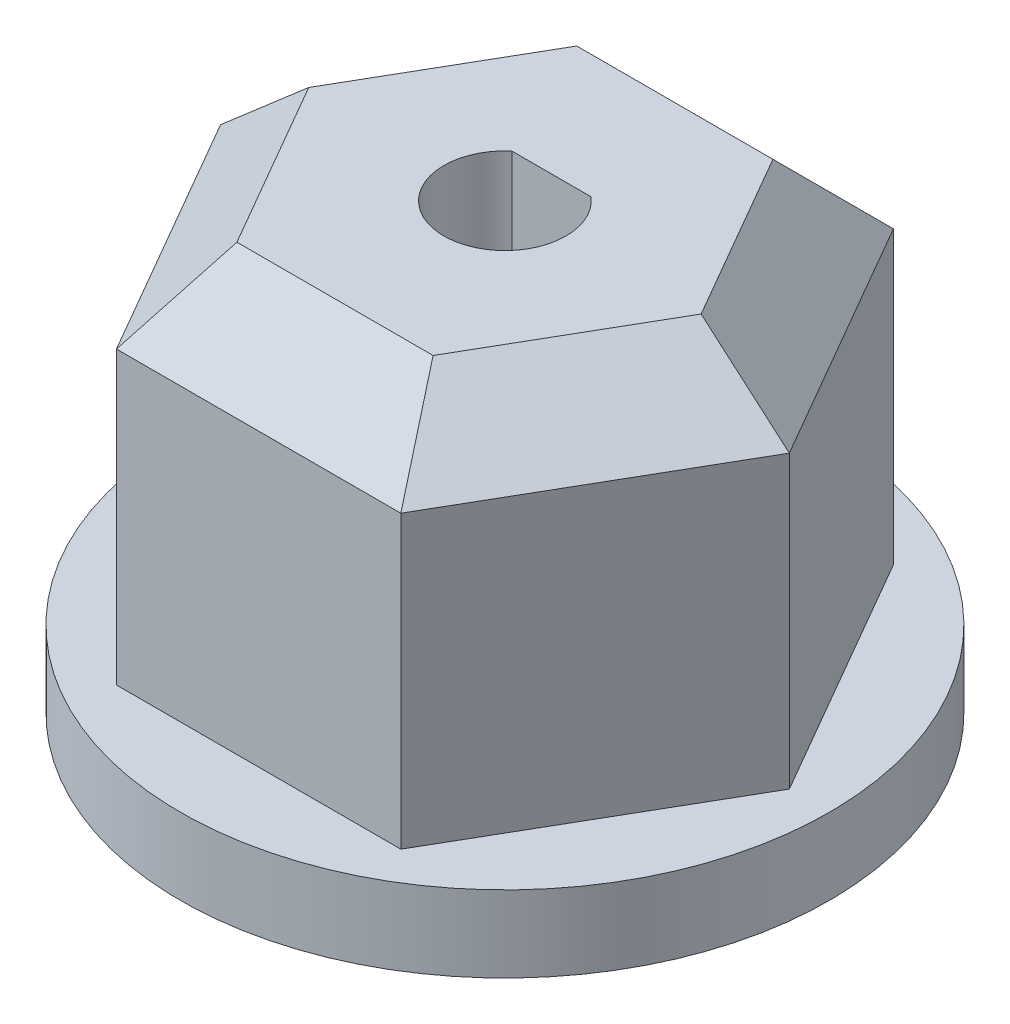
ISO-10303-21;
HEADER;
FILE_DESCRIPTION(('STEP AP214'),'2;1');
FILE_NAME('part.step','',(''),(''),'','','');
FILE_SCHEMA(('AUTOMOTIVE_DESIGN { 1 0 10303 214 1 1 1 1 }'));
ENDSEC;
DATA;
#1=APPLICATION_CONTEXT('core data for automotive mechanical design processes');
#2=APPLICATION_PROTOCOL_DEFINITION('international standard','automotive_design',2000,#1);
#3=PRODUCT_CONTEXT('',#1,'mechanical');
#4=PRODUCT('Part','Part','',(#3));
#5=PRODUCT_RELATED_PRODUCT_CATEGORY('part','',(#4));
#6=PRODUCT_DEFINITION_FORMATION('','',#4);
#7=PRODUCT_DEFINITION_CONTEXT('part definition',#1,'design');
#8=PRODUCT_DEFINITION('design','',#6,#7);
#9=PRODUCT_DEFINITION_SHAPE('','',#8);
#10=(LENGTH_UNIT() NAMED_UNIT(*) SI_UNIT(.MILLI.,.METRE.));
#11=(NAMED_UNIT(*) PLANE_ANGLE_UNIT() SI_UNIT($,.RADIAN.));
#12=(NAMED_UNIT(*) SI_UNIT($,.STERADIAN.) SOLID_ANGLE_UNIT());
#13=UNCERTAINTY_MEASURE_WITH_UNIT(LENGTH_MEASURE(1.E-05),#10,'distance_accuracy_value','');
#14=(GEOMETRIC_REPRESENTATION_CONTEXT(3) GLOBAL_UNCERTAINTY_ASSIGNED_CONTEXT((#13)) GLOBAL_UNIT_ASSIGNED_CONTEXT((#10,
#11,#12)) REPRESENTATION_CONTEXT('',''));
#15=CARTESIAN_POINT('',(0.,0.,0.));
#16=DIRECTION('',(0.,0.,1.));
#17=DIRECTION('',(1.,0.,0.));
#18=AXIS2_PLACEMENT_3D('',#15,#16,#17);
#19=CARTESIAN_POINT('',(7.44781847254618,7.62,0.));
#20=DIRECTION('',(-0.866025403784438,0.,0.5));
#21=DIRECTION('',(0.5,0.,0.866025403784439));
#22=AXIS2_PLACEMENT_3D('',#19,#20,#21);
#23=PLANE('',#22);
#24=DIRECTION('',(0.,-1.,0.));
#25=VECTOR('',#24,1.);
#26=CARTESIAN_POINT('',(3.72390923627309,7.62,-6.45));
#27=LINE('',#26,#25);
#28=CARTESIAN_POINT('',(3.72390923627309,7.62,-6.45));
#29=VERTEX_POINT('',#28);
#30=CARTESIAN_POINT('',(3.72390923627309,0.,-6.45));
#31=VERTEX_POINT('',#30);
#32=EDGE_CURVE('E218',#29,#31,#27,.T.);
#33=ORIENTED_EDGE('',*,*,#32,.F.);
#34=DIRECTION('',(0.5,0.,0.866025403784439));
#35=VECTOR('',#34,1.);
#36=CARTESIAN_POINT('',(7.44781847254618,7.62,0.));
#37=LINE('',#36,#35);
#38=CARTESIAN_POINT('',(7.44781847254618,7.62,0.));
#39=VERTEX_POINT('',#38);
#40=EDGE_CURVE('E247',#29,#39,#37,.T.);
#41=ORIENTED_EDGE('',*,*,#40,.T.);
#42=DIRECTION('',(0.,-1.,0.));
#43=VECTOR('',#42,1.);
#44=CARTESIAN_POINT('',(7.44781847254618,7.62,0.));
#45=LINE('',#44,#43);
#46=CARTESIAN_POINT('',(7.44781847254618,0.,0.));
#47=VERTEX_POINT('',#46);
#48=EDGE_CURVE('E203',#39,#47,#45,.T.);
#49=ORIENTED_EDGE('',*,*,#48,.T.);
#50=DIRECTION('',(-0.5,0.,-0.866025403784438));
#51=VECTOR('',#50,1.);
#52=CARTESIAN_POINT('',(7.44781847254618,0.,0.));
#53=LINE('',#52,#51);
#54=EDGE_CURVE('E179',#47,#31,#53,.T.);
#55=ORIENTED_EDGE('',*,*,#54,.T.);
#56=EDGE_LOOP('',(#33,#41,#49,#55));
#57=FACE_BOUND('',#56,.T.);
#58=ADVANCED_FACE('F43',(#57),#23,.F.);
#59=CARTESIAN_POINT('',(3.72390923627309,7.62,-6.45));
#60=DIRECTION('',(0.,0.,1.));
#61=DIRECTION('',(1.,0.,0.));
#62=AXIS2_PLACEMENT_3D('',#59,#60,#61);
#63=PLANE('',#62);
#64=DIRECTION('',(0.,-1.,0.));
#65=VECTOR('',#64,1.);
#66=CARTESIAN_POINT('',(-3.72390923627309,7.62,-6.45));
#67=LINE('',#66,#65);
#68=CARTESIAN_POINT('',(-3.72390923627309,7.62,-6.45));
#69=VERTEX_POINT('',#68);
#70=CARTESIAN_POINT('',(-3.72390923627309,0.,-6.45));
#71=VERTEX_POINT('',#70);
#72=EDGE_CURVE('E215',#69,#71,#67,.T.);
#73=ORIENTED_EDGE('',*,*,#72,.F.);
#74=DIRECTION('',(1.,0.,0.));
#75=VECTOR('',#74,1.);
#76=CARTESIAN_POINT('',(3.72390923627309,7.62,-6.45));
#77=LINE('',#76,#75);
#78=EDGE_CURVE('E244',#69,#29,#77,.T.);
#79=ORIENTED_EDGE('',*,*,#78,.T.);
#80=ORIENTED_EDGE('',*,*,#32,.T.);
#81=DIRECTION('',(-1.,0.,0.));
#82=VECTOR('',#81,1.);
#83=CARTESIAN_POINT('',(3.72390923627309,0.,-6.45));
#84=LINE('',#83,#82);
#85=EDGE_CURVE('E183',#31,#71,#84,.T.);
#86=ORIENTED_EDGE('',*,*,#85,.T.);
#87=EDGE_LOOP('',(#73,#79,#80,#86));
#88=FACE_BOUND('',#87,.T.);
#89=ADVANCED_FACE('F340',(#88),#63,.F.);
#90=CARTESIAN_POINT('',(-3.72390923627309,7.62,-6.45));
#91=DIRECTION('',(0.866025403784439,0.,0.5));
#92=DIRECTION('',(0.5,0.,-0.866025403784439));
#93=AXIS2_PLACEMENT_3D('',#90,#91,#92);
#94=PLANE('',#93);
#95=DIRECTION('',(0.,-1.,0.));
#96=VECTOR('',#95,1.);
#97=CARTESIAN_POINT('',(-7.44781847254617,7.62,0.));
#98=LINE('',#97,#96);
#99=CARTESIAN_POINT('',(-7.44781847254617,7.62,0.));
#100=VERTEX_POINT('',#99);
#101=CARTESIAN_POINT('',(-7.44781847254617,0.,0.));
#102=VERTEX_POINT('',#101);
#103=EDGE_CURVE('E212',#100,#102,#98,.T.);
#104=ORIENTED_EDGE('',*,*,#103,.F.);
#105=DIRECTION('',(0.5,0.,-0.866025403784439));
#106=VECTOR('',#105,1.);
#107=CARTESIAN_POINT('',(-3.72390923627309,7.62,-6.45));
#108=LINE('',#107,#106);
#109=EDGE_CURVE('E240',#100,#69,#108,.T.);
#110=ORIENTED_EDGE('',*,*,#109,.T.);
#111=ORIENTED_EDGE('',*,*,#72,.T.);
#112=DIRECTION('',(-0.5,0.,0.866025403784439));
#113=VECTOR('',#112,1.);
#114=CARTESIAN_POINT('',(-3.72390923627309,0.,-6.45));
#115=LINE('',#114,#113);
#116=EDGE_CURVE('E187',#71,#102,#115,.T.);
#117=ORIENTED_EDGE('',*,*,#116,.T.);
#118=EDGE_LOOP('',(#104,#110,#111,#117));
#119=FACE_BOUND('',#118,.T.);
#120=ADVANCED_FACE('F344',(#119),#94,.F.);
#121=CARTESIAN_POINT('',(-7.44781847254617,7.62,0.));
#122=DIRECTION('',(0.866025403784439,0.,-0.5));
#123=DIRECTION('',(-0.5,0.,-0.866025403784439));
#124=AXIS2_PLACEMENT_3D('',#121,#122,#123);
#125=PLANE('',#124);
#126=DIRECTION('',(0.,-1.,0.));
#127=VECTOR('',#126,1.);
#128=CARTESIAN_POINT('',(-3.72390923627309,7.62,6.45));
#129=LINE('',#128,#127);
#130=CARTESIAN_POINT('',(-3.72390923627309,7.62,6.45));
#131=VERTEX_POINT('',#130);
#132=CARTESIAN_POINT('',(-3.72390923627309,0.,6.45));
#133=VERTEX_POINT('',#132);
#134=EDGE_CURVE('E209',#131,#133,#129,.T.);
#135=ORIENTED_EDGE('',*,*,#134,.F.);
#136=DIRECTION('',(-0.5,0.,-0.866025403784439));
#137=VECTOR('',#136,1.);
#138=CARTESIAN_POINT('',(-7.44781847254617,7.62,0.));
#139=LINE('',#138,#137);
#140=EDGE_CURVE('E256',#131,#100,#139,.T.);
#141=ORIENTED_EDGE('',*,*,#140,.T.);
#142=ORIENTED_EDGE('',*,*,#103,.T.);
#143=DIRECTION('',(0.5,0.,0.866025403784438));
#144=VECTOR('',#143,1.);
#145=CARTESIAN_POINT('',(-7.44781847254617,0.,0.));
#146=LINE('',#145,#144);
#147=EDGE_CURVE('E191',#102,#133,#146,.T.);
#148=ORIENTED_EDGE('',*,*,#147,.T.);
#149=EDGE_LOOP('',(#135,#141,#142,#148));
#150=FACE_BOUND('',#149,.T.);
#151=ADVANCED_FACE('F348',(#150),#125,.F.);
#152=CARTESIAN_POINT('',(-3.72390923627309,7.62,6.45));
#153=DIRECTION('',(0.,0.,-1.));
#154=DIRECTION('',(-1.,0.,0.));
#155=AXIS2_PLACEMENT_3D('',#152,#153,#154);
#156=PLANE('',#155);
#157=DIRECTION('',(0.,-1.,0.));
#158=VECTOR('',#157,1.);
#159=CARTESIAN_POINT('',(3.72390923627309,7.62,6.45));
#160=LINE('',#159,#158);
#161=CARTESIAN_POINT('',(3.72390923627309,7.62,6.45));
#162=VERTEX_POINT('',#161);
#163=CARTESIAN_POINT('',(3.72390923627309,0.,6.45));
#164=VERTEX_POINT('',#163);
#165=EDGE_CURVE('E206',#162,#164,#160,.T.);
#166=ORIENTED_EDGE('',*,*,#165,.F.);
#167=DIRECTION('',(-1.,0.,0.));
#168=VECTOR('',#167,1.);
#169=CARTESIAN_POINT('',(-3.72390923627309,7.62,6.45));
#170=LINE('',#169,#168);
#171=EDGE_CURVE('E253',#162,#131,#170,.T.);
#172=ORIENTED_EDGE('',*,*,#171,.T.);
#173=ORIENTED_EDGE('',*,*,#134,.T.);
#174=DIRECTION('',(1.,0.,0.));
#175=VECTOR('',#174,1.);
#176=CARTESIAN_POINT('',(-3.72390923627309,0.,6.45));
#177=LINE('',#176,#175);
#178=EDGE_CURVE('E195',#133,#164,#177,.T.);
#179=ORIENTED_EDGE('',*,*,#178,.T.);
#180=EDGE_LOOP('',(#166,#172,#173,#179));
#181=FACE_BOUND('',#180,.T.);
#182=ADVANCED_FACE('F352',(#181),#156,.F.);
#183=CARTESIAN_POINT('',(3.72390923627309,7.62,6.45));
#184=DIRECTION('',(-0.866025403784439,0.,-0.5));
#185=DIRECTION('',(-0.5,0.,0.866025403784439));
#186=AXIS2_PLACEMENT_3D('',#183,#184,#185);
#187=PLANE('',#186);
#188=ORIENTED_EDGE('',*,*,#48,.F.);
#189=DIRECTION('',(-0.5,0.,0.866025403784439));
#190=VECTOR('',#189,1.);
#191=CARTESIAN_POINT('',(3.72390923627309,7.62,6.45));
#192=LINE('',#191,#190);
#193=EDGE_CURVE('E250',#39,#162,#192,.T.);
#194=ORIENTED_EDGE('',*,*,#193,.T.);
#195=ORIENTED_EDGE('',*,*,#165,.T.);
#196=DIRECTION('',(0.5,0.,-0.866025403784439));
#197=VECTOR('',#196,1.);
#198=CARTESIAN_POINT('',(3.72390923627309,0.,6.45));
#199=LINE('',#198,#197);
#200=EDGE_CURVE('E199',#164,#47,#199,.T.);
#201=ORIENTED_EDGE('',*,*,#200,.T.);
#202=EDGE_LOOP('',(#188,#194,#195,#201));
#203=FACE_BOUND('',#202,.T.);
#204=ADVANCED_FACE('F356',(#203),#187,.F.);
#205=CARTESIAN_POINT('',(0.,7.62,0.));
#206=DIRECTION('',(0.,-1.,0.));
#207=DIRECTION('',(0.,0.,-1.));
#208=AXIS2_PLACEMENT_3D('',#205,#206,#207);
#209=CYLINDRICAL_SURFACE('',#208,1.6);
#210=DIRECTION('',(0.,-1.,0.));
#211=VECTOR('',#210,1.);
#212=CARTESIAN_POINT('',(1.03749371190867,7.62,-1.21803398874989));
#213=LINE('',#212,#211);
#214=CARTESIAN_POINT('',(1.03749371190867,9.62,-1.21803398874989));
#215=VERTEX_POINT('',#214);
#216=CARTESIAN_POINT('',(1.03749371190867,-0.999999999999981,-1.21803398874989));
#217=VERTEX_POINT('',#216);
#218=EDGE_CURVE('E153',#215,#217,#213,.T.);
#219=ORIENTED_EDGE('',*,*,#218,.T.);
#220=CARTESIAN_POINT('',(0.,-0.999999999999984,0.));
#221=DIRECTION('',(0.,-1.,0.));
#222=DIRECTION('',(0.,0.,-1.));
#223=AXIS2_PLACEMENT_3D('',#220,#221,#222);
#224=CIRCLE('',#223,1.6);
#225=CARTESIAN_POINT('',(-1.03749371190867,-0.999999999999981,-1.21803398874989));
#226=VERTEX_POINT('',#225);
#227=EDGE_CURVE('E11',#217,#226,#224,.T.);
#228=ORIENTED_EDGE('',*,*,#227,.T.);
#229=DIRECTION('',(0.,-1.,0.));
#230=VECTOR('',#229,1.);
#231=CARTESIAN_POINT('',(-1.03749371190867,7.62,-1.21803398874989));
#232=LINE('',#231,#230);
#233=CARTESIAN_POINT('',(-1.03749371190867,9.62,-1.21803398874989));
#234=VERTEX_POINT('',#233);
#235=EDGE_CURVE('E142',#234,#226,#232,.T.);
#236=ORIENTED_EDGE('',*,*,#235,.F.);
#237=CARTESIAN_POINT('',(0.,9.62,0.));
#238=DIRECTION('',(0.,1.,0.));
#239=DIRECTION('',(0.,0.,1.));
#240=AXIS2_PLACEMENT_3D('',#237,#238,#239);
#241=CIRCLE('',#240,1.6);
#242=EDGE_CURVE('E147',#234,#215,#241,.T.);
#243=ORIENTED_EDGE('',*,*,#242,.T.);
#244=EDGE_LOOP('',(#219,#228,#236,#243));
#245=FACE_BOUND('',#244,.T.);
#246=ADVANCED_FACE('F145',(#245),#209,.F.);
#247=CARTESIAN_POINT('',(-1.03749371190867,7.62,-1.21803398874989));
#248=DIRECTION('',(0.,0.,1.));
#249=DIRECTION('',(1.,0.,0.));
#250=AXIS2_PLACEMENT_3D('',#247,#248,#249);
#251=PLANE('',#250);
#252=ORIENTED_EDGE('',*,*,#235,.T.);
#253=DIRECTION('',(1.,0.,0.));
#254=VECTOR('',#253,1.);
#255=CARTESIAN_POINT('',(-1.03749371190867,-0.999999999999984,-1.21803398874989));
#256=LINE('',#255,#254);
#257=EDGE_CURVE('E259',#226,#217,#256,.T.);
#258=ORIENTED_EDGE('',*,*,#257,.T.);
#259=ORIENTED_EDGE('',*,*,#218,.F.);
#260=DIRECTION('',(-1.,0.,0.));
#261=VECTOR('',#260,1.);
#262=CARTESIAN_POINT('',(1.03749371190867,9.62,-1.21803398874989));
#263=LINE('',#262,#261);
#264=EDGE_CURVE('E156',#215,#234,#263,.T.);
#265=ORIENTED_EDGE('',*,*,#264,.T.);
#266=EDGE_LOOP('',(#252,#258,#259,#265));
#267=FACE_BOUND('',#266,.T.);
#268=ADVANCED_FACE('F157',(#267),#251,.T.);
#269=CARTESIAN_POINT('',(0.,-2.,0.));
#270=DIRECTION('',(0.,-1.,0.));
#271=DIRECTION('',(0.,0.,-1.));
#272=AXIS2_PLACEMENT_3D('',#269,#270,#271);
#273=PLANE('',#272);
#274=CARTESIAN_POINT('',(0.,-2.,0.));
#275=DIRECTION('',(0.,-1.,0.));
#276=DIRECTION('',(0.,0.,-1.));
#277=AXIS2_PLACEMENT_3D('',#274,#275,#276);
#278=CIRCLE('',#277,2.60000000000002);
#279=CARTESIAN_POINT('',(-1.35658587076169,-2.,-2.21803398874991));
#280=VERTEX_POINT('',#279);
#281=CARTESIAN_POINT('',(1.35658587076169,-2.,-2.21803398874991));
#282=VERTEX_POINT('',#281);
#283=EDGE_CURVE('E66',#280,#282,#278,.F.);
#284=ORIENTED_EDGE('',*,*,#283,.T.);
#285=DIRECTION('',(-1.,0.,0.));
#286=VECTOR('',#285,1.);
#287=CARTESIAN_POINT('',(0.,-2.,-2.21803398874991));
#288=LINE('',#287,#286);
#289=EDGE_CURVE('E59',#282,#280,#288,.T.);
#290=ORIENTED_EDGE('',*,*,#289,.T.);
#291=EDGE_LOOP('',(#284,#290));
#292=FACE_BOUND('',#291,.T.);
#293=CARTESIAN_POINT('',(0.,-2.,0.));
#294=DIRECTION('',(0.,-1.,0.));
#295=DIRECTION('',(0.,0.,-1.));
#296=AXIS2_PLACEMENT_3D('',#293,#294,#295);
#297=CIRCLE('',#296,8.5);
#298=CARTESIAN_POINT('',(0.,-2.,-8.5));
#299=VERTEX_POINT('',#298);
#300=EDGE_CURVE('E154',#299,#299,#297,.T.);
#301=ORIENTED_EDGE('',*,*,#300,.T.);
#302=EDGE_LOOP('',(#301));
#303=FACE_BOUND('',#302,.T.);
#304=ADVANCED_FACE('F365',(#292,#303),#273,.T.);
#305=CARTESIAN_POINT('',(0.,0.,0.));
#306=DIRECTION('',(0.,-1.,0.));
#307=DIRECTION('',(0.,0.,-1.));
#308=AXIS2_PLACEMENT_3D('',#305,#306,#307);
#309=PLANE('',#308);
#310=ORIENTED_EDGE('',*,*,#54,.F.);
#311=ORIENTED_EDGE('',*,*,#200,.F.);
#312=ORIENTED_EDGE('',*,*,#178,.F.);
#313=ORIENTED_EDGE('',*,*,#147,.F.);
#314=ORIENTED_EDGE('',*,*,#116,.F.);
#315=ORIENTED_EDGE('',*,*,#85,.F.);
#316=EDGE_LOOP('',(#310,#311,#312,#313,#314,#315));
#317=FACE_BOUND('',#316,.T.);
#318=CARTESIAN_POINT('',(0.,0.,0.));
#319=DIRECTION('',(0.,-1.,0.));
#320=DIRECTION('',(0.,0.,-1.));
#321=AXIS2_PLACEMENT_3D('',#318,#319,#320);
#322=CIRCLE('',#321,8.5);
#323=CARTESIAN_POINT('',(0.,0.,-8.5));
#324=VERTEX_POINT('',#323);
#325=EDGE_CURVE('E160',#324,#324,#322,.T.);
#326=ORIENTED_EDGE('',*,*,#325,.F.);
#327=EDGE_LOOP('',(#326));
#328=FACE_BOUND('',#327,.T.);
#329=ADVANCED_FACE('F369',(#317,#328),#309,.F.);
#330=CARTESIAN_POINT('',(0.,-2.,0.));
#331=DIRECTION('',(0.,1.,0.));
#332=DIRECTION('',(0.,0.,1.));
#333=AXIS2_PLACEMENT_3D('',#330,#331,#332);
#334=CYLINDRICAL_SURFACE('',#333,8.5);
#335=ORIENTED_EDGE('',*,*,#300,.F.);
#336=EDGE_LOOP('',(#335));
#337=FACE_BOUND('',#336,.T.);
#338=ORIENTED_EDGE('',*,*,#325,.T.);
#339=EDGE_LOOP('',(#338));
#340=FACE_BOUND('',#339,.T.);
#341=ADVANCED_FACE('F366',(#337,#340),#334,.T.);
#342=CARTESIAN_POINT('',(0.,9.62,0.));
#343=DIRECTION('',(0.,1.,0.));
#344=DIRECTION('',(0.,0.,1.));
#345=AXIS2_PLACEMENT_3D('',#342,#343,#344);
#346=PLANE('',#345);
#347=DIRECTION('',(-1.,0.,0.));
#348=VECTOR('',#347,1.);
#349=CARTESIAN_POINT('',(-3.72390923627309,9.62,-4.45));
#350=LINE('',#349,#348);
#351=CARTESIAN_POINT('',(2.56920869789383,9.62,-4.45));
#352=VERTEX_POINT('',#351);
#353=CARTESIAN_POINT('',(-2.56920869789383,9.62,-4.45));
#354=VERTEX_POINT('',#353);
#355=EDGE_CURVE('E233',#352,#354,#350,.T.);
#356=ORIENTED_EDGE('',*,*,#355,.T.);
#357=DIRECTION('',(-0.5,0.,0.866025403784439));
#358=VECTOR('',#357,1.);
#359=CARTESIAN_POINT('',(-5.7157676649773,9.62,0.999999999999999));
#360=LINE('',#359,#358);
#361=CARTESIAN_POINT('',(-5.13841739578767,9.62,0.));
#362=VERTEX_POINT('',#361);
#363=EDGE_CURVE('E236',#354,#362,#360,.T.);
#364=ORIENTED_EDGE('',*,*,#363,.T.);
#365=DIRECTION('',(0.5,0.,0.866025403784439));
#366=VECTOR('',#365,1.);
#367=CARTESIAN_POINT('',(-1.99185842870421,9.62,5.45));
#368=LINE('',#367,#366);
#369=CARTESIAN_POINT('',(-2.56920869789383,9.62,4.45));
#370=VERTEX_POINT('',#369);
#371=EDGE_CURVE('E221',#362,#370,#368,.T.);
#372=ORIENTED_EDGE('',*,*,#371,.T.);
#373=DIRECTION('',(1.,0.,0.));
#374=VECTOR('',#373,1.);
#375=CARTESIAN_POINT('',(3.72390923627309,9.62,4.45));
#376=LINE('',#375,#374);
#377=CARTESIAN_POINT('',(2.56920869789384,9.62,4.45));
#378=VERTEX_POINT('',#377);
#379=EDGE_CURVE('E224',#370,#378,#376,.T.);
#380=ORIENTED_EDGE('',*,*,#379,.T.);
#381=DIRECTION('',(0.5,0.,-0.866025403784439));
#382=VECTOR('',#381,1.);
#383=CARTESIAN_POINT('',(5.7157676649773,9.62,-1.));
#384=LINE('',#383,#382);
#385=CARTESIAN_POINT('',(5.13841739578767,9.62,0.));
#386=VERTEX_POINT('',#385);
#387=EDGE_CURVE('E227',#378,#386,#384,.T.);
#388=ORIENTED_EDGE('',*,*,#387,.T.);
#389=DIRECTION('',(-0.5,0.,-0.866025403784439));
#390=VECTOR('',#389,1.);
#391=CARTESIAN_POINT('',(1.99185842870421,9.62,-5.45));
#392=LINE('',#391,#390);
#393=EDGE_CURVE('E230',#386,#352,#392,.T.);
#394=ORIENTED_EDGE('',*,*,#393,.T.);
#395=EDGE_LOOP('',(#356,#364,#372,#380,#388,#394));
#396=FACE_BOUND('',#395,.T.);
#397=ORIENTED_EDGE('',*,*,#264,.F.);
#398=ORIENTED_EDGE('',*,*,#242,.F.);
#399=EDGE_LOOP('',(#397,#398));
#400=FACE_BOUND('',#399,.T.);
#401=ADVANCED_FACE('F162',(#396,#400),#346,.T.);
#402=CARTESIAN_POINT('',(3.85381304684075,9.62,2.225));
#403=DIRECTION('',(0.612372435695795,0.707106781186547,0.353553390593274));
#404=DIRECTION('',(-0.5,0.,0.866025403784439));
#405=AXIS2_PLACEMENT_3D('',#402,#403,#404);
#406=PLANE('',#405);
#407=DIRECTION('',(-0.377964473009228,0.654653670707978,-0.654653670707977));
#408=VECTOR('',#407,1.);
#409=CARTESIAN_POINT('',(2.202178883909,10.2557142857143,3.81428571428571));
#410=LINE('',#409,#408);
#411=EDGE_CURVE('E168',#162,#378,#410,.T.);
#412=ORIENTED_EDGE('',*,*,#411,.F.);
#413=ORIENTED_EDGE('',*,*,#193,.F.);
#414=DIRECTION('',(-0.755928946018454,0.654653670707977,0.));
#415=VECTOR('',#414,1.);
#416=CARTESIAN_POINT('',(4.404357767818,10.2557142857143,0.));
#417=LINE('',#416,#415);
#418=EDGE_CURVE('E164',#386,#39,#417,.F.);
#419=ORIENTED_EDGE('',*,*,#418,.F.);
#420=ORIENTED_EDGE('',*,*,#387,.F.);
#421=EDGE_LOOP('',(#412,#413,#419,#420));
#422=FACE_BOUND('',#421,.T.);
#423=ADVANCED_FACE('F296',(#422),#406,.T.);
#424=CARTESIAN_POINT('',(3.85381304684075,9.62,-2.225));
#425=DIRECTION('',(0.612372435695794,0.707106781186547,-0.353553390593274));
#426=DIRECTION('',(0.5,0.,0.866025403784439));
#427=AXIS2_PLACEMENT_3D('',#424,#425,#426);
#428=PLANE('',#427);
#429=ORIENTED_EDGE('',*,*,#418,.T.);
#430=ORIENTED_EDGE('',*,*,#40,.F.);
#431=DIRECTION('',(-0.377964473009228,0.654653670707977,0.654653670707977));
#432=VECTOR('',#431,1.);
#433=CARTESIAN_POINT('',(2.202178883909,10.2557142857143,-3.81428571428572));
#434=LINE('',#433,#432);
#435=EDGE_CURVE('E270',#352,#29,#434,.F.);
#436=ORIENTED_EDGE('',*,*,#435,.F.);
#437=ORIENTED_EDGE('',*,*,#393,.F.);
#438=EDGE_LOOP('',(#429,#430,#436,#437));
#439=FACE_BOUND('',#438,.T.);
#440=ADVANCED_FACE('F303',(#439),#428,.T.);
#441=CARTESIAN_POINT('',(0.,9.62,4.45));
#442=DIRECTION('',(0.,0.707106781186547,0.707106781186548));
#443=DIRECTION('',(-1.,0.,0.));
#444=AXIS2_PLACEMENT_3D('',#441,#442,#443);
#445=PLANE('',#444);
#446=ORIENTED_EDGE('',*,*,#411,.T.);
#447=ORIENTED_EDGE('',*,*,#379,.F.);
#448=DIRECTION('',(0.377964473009228,0.654653670707977,-0.654653670707977));
#449=VECTOR('',#448,1.);
#450=CARTESIAN_POINT('',(-2.202178883909,10.2557142857143,3.81428571428572));
#451=LINE('',#450,#449);
#452=EDGE_CURVE('E266',#131,#370,#451,.T.);
#453=ORIENTED_EDGE('',*,*,#452,.F.);
#454=ORIENTED_EDGE('',*,*,#171,.F.);
#455=EDGE_LOOP('',(#446,#447,#453,#454));
#456=FACE_BOUND('',#455,.T.);
#457=ADVANCED_FACE('F310',(#456),#445,.T.);
#458=CARTESIAN_POINT('',(0.,9.62,-4.45));
#459=DIRECTION('',(0.,0.707106781186547,-0.707106781186548));
#460=DIRECTION('',(1.,0.,0.));
#461=AXIS2_PLACEMENT_3D('',#458,#459,#460);
#462=PLANE('',#461);
#463=ORIENTED_EDGE('',*,*,#435,.T.);
#464=ORIENTED_EDGE('',*,*,#78,.F.);
#465=DIRECTION('',(0.377964473009228,0.654653670707977,0.654653670707977));
#466=VECTOR('',#465,1.);
#467=CARTESIAN_POINT('',(-2.202178883909,10.2557142857143,-3.81428571428572));
#468=LINE('',#467,#466);
#469=EDGE_CURVE('E263',#354,#69,#468,.F.);
#470=ORIENTED_EDGE('',*,*,#469,.F.);
#471=ORIENTED_EDGE('',*,*,#355,.F.);
#472=EDGE_LOOP('',(#463,#464,#470,#471));
#473=FACE_BOUND('',#472,.T.);
#474=ADVANCED_FACE('F317',(#473),#462,.T.);
#475=CARTESIAN_POINT('',(-3.85381304684075,9.62,2.225));
#476=DIRECTION('',(-0.612372435695794,0.707106781186548,0.353553390593274));
#477=DIRECTION('',(-0.5,0.,-0.866025403784439));
#478=AXIS2_PLACEMENT_3D('',#475,#476,#477);
#479=PLANE('',#478);
#480=ORIENTED_EDGE('',*,*,#452,.T.);
#481=ORIENTED_EDGE('',*,*,#371,.F.);
#482=DIRECTION('',(-0.755928946018455,-0.654653670707977,0.));
#483=VECTOR('',#482,1.);
#484=CARTESIAN_POINT('',(-4.404357767818,10.2557142857143,0.));
#485=LINE('',#484,#483);
#486=EDGE_CURVE('E260',#100,#362,#485,.F.);
#487=ORIENTED_EDGE('',*,*,#486,.F.);
#488=ORIENTED_EDGE('',*,*,#140,.F.);
#489=EDGE_LOOP('',(#480,#481,#487,#488));
#490=FACE_BOUND('',#489,.T.);
#491=ADVANCED_FACE('F324',(#490),#479,.T.);
#492=CARTESIAN_POINT('',(-3.85381304684075,9.62,-2.225));
#493=DIRECTION('',(-0.612372435695795,0.707106781186548,-0.353553390593274));
#494=DIRECTION('',(0.5,0.,-0.866025403784439));
#495=AXIS2_PLACEMENT_3D('',#492,#493,#494);
#496=PLANE('',#495);
#497=ORIENTED_EDGE('',*,*,#469,.T.);
#498=ORIENTED_EDGE('',*,*,#109,.F.);
#499=ORIENTED_EDGE('',*,*,#486,.T.);
#500=ORIENTED_EDGE('',*,*,#363,.F.);
#501=EDGE_LOOP('',(#497,#498,#499,#500));
#502=FACE_BOUND('',#501,.T.);
#503=ADVANCED_FACE('F331',(#502),#496,.T.);
#504=CARTESIAN_POINT('',(0.,-0.999999999999984,0.));
#505=DIRECTION('',(0.,-1.,0.));
#506=DIRECTION('',(0.,0.,-1.));
#507=AXIS2_PLACEMENT_3D('',#504,#505,#506);
#508=CONICAL_SURFACE('',#507,1.6,0.785398163397449);
#509=CARTESIAN_POINT('',(1.03749371190867,-0.999999999999981,-1.21803398874989));
#510=CARTESIAN_POINT('',(1.06791417581688,-1.08270563963091,-1.30073962838082));
#511=CARTESIAN_POINT('',(1.09713310669653,-1.16562650591117,-1.38366049466108));
#512=CARTESIAN_POINT('',(1.15354778254297,-1.3317944949562,-1.54982848370611));
#513=CARTESIAN_POINT('',(1.18074394120844,-1.41504154732255,-1.63307553607247));
#514=CARTESIAN_POINT('',(1.23350204561681,-1.58178200929003,-1.79981599803995));
#515=CARTESIAN_POINT('',(1.25906418107026,-1.66527538911066,-1.88330937786058));
#516=CARTESIAN_POINT('',(1.30880435353487,-1.83248615050881,-2.05052013925872));
#517=CARTESIAN_POINT('',(1.33298210753351,-1.91620357425253,-2.13423756300245));
#518=CARTESIAN_POINT('',(1.35658587076169,-2.,-2.21803398874991));
#519=B_SPLINE_CURVE_WITH_KNOTS('',3,(#509,#510,#511,#512,#513,#514,#515,#516,#517,#518),
.UNSPECIFIED.,.F.,.F.,(4,2,2,2,4),(0.,0.362546354982165,0.725018356689725,1.08744819857808,
1.44995187028644),.UNSPECIFIED.);
#520=EDGE_CURVE('E282',#282,#217,#519,.F.);
#521=ORIENTED_EDGE('',*,*,#520,.F.);
#522=ORIENTED_EDGE('',*,*,#283,.F.);
#523=CARTESIAN_POINT('',(-1.35658587076169,-2.,-2.21803398874991));
#524=CARTESIAN_POINT('',(-1.3329821075335,-1.91620357425253,-2.13423756300245));
#525=CARTESIAN_POINT('',(-1.30880435353487,-1.83248615050881,-2.05052013925872));
#526=CARTESIAN_POINT('',(-1.25906418107026,-1.66527538911067,-1.88330937786058));
#527=CARTESIAN_POINT('',(-1.23350204561681,-1.58178200929003,-1.79981599803995));
#528=CARTESIAN_POINT('',(-1.18074394120844,-1.41504154732255,-1.63307553607247));
#529=CARTESIAN_POINT('',(-1.15354778254297,-1.3317944949562,-1.54982848370611));
#530=CARTESIAN_POINT('',(-1.09713310669653,-1.16562650591117,-1.38366049466108));
#531=CARTESIAN_POINT('',(-1.06791417581688,-1.08270563963091,-1.30073962838082));
#532=CARTESIAN_POINT('',(-1.03749371190867,-0.999999999999982,-1.21803398874989));
#533=B_SPLINE_CURVE_WITH_KNOTS('',3,(#523,#524,#525,#526,#527,#528,#529,#530,#531,#532),
.UNSPECIFIED.,.F.,.F.,(4,2,2,2,4),(0.,0.362503671708364,0.724933513596714,1.08740551530427,
1.44995187028644),.UNSPECIFIED.);
#534=EDGE_CURVE('E49',#226,#280,#533,.F.);
#535=ORIENTED_EDGE('',*,*,#534,.F.);
#536=ORIENTED_EDGE('',*,*,#227,.F.);
#537=EDGE_LOOP('',(#521,#522,#535,#536));
#538=FACE_BOUND('',#537,.T.);
#539=ADVANCED_FACE('F46',(#538),#508,.F.);
#540=CARTESIAN_POINT('',(-1.03749371190867,-0.999999999999984,-1.21803398874989));
#541=DIRECTION('',(0.,0.707106781186548,-0.707106781186547));
#542=DIRECTION('',(1.,0.,0.));
#543=AXIS2_PLACEMENT_3D('',#540,#541,#542);
#544=PLANE('',#543);
#545=ORIENTED_EDGE('',*,*,#534,.T.);
#546=ORIENTED_EDGE('',*,*,#289,.F.);
#547=ORIENTED_EDGE('',*,*,#520,.T.);
#548=ORIENTED_EDGE('',*,*,#257,.F.);
#549=EDGE_LOOP('',(#545,#546,#547,#548));
#550=FACE_BOUND('',#549,.T.);
#551=ADVANCED_FACE('F289',(#550),#544,.F.);
#552=CLOSED_SHELL('',(#58,#89,#120,#151,#182,#204,#246,#268,#304,#329,#341,#401,#423,#440,#457,
#474,#491,#503,#539,#551));
#553=MANIFOLD_SOLID_BREP('B2',#552);
#554=ADVANCED_BREP_SHAPE_REPRESENTATION('',(#18,#553),#14);
#555=SHAPE_DEFINITION_REPRESENTATION(#9,#554);
ENDSEC;
END-ISO-10303-21;
